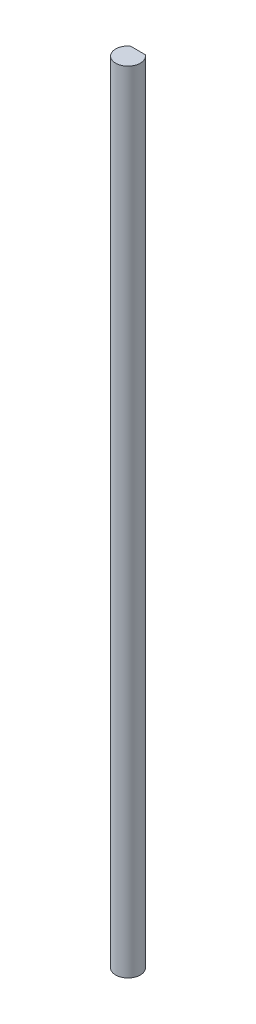
ISO-10303-21;
HEADER;
FILE_DESCRIPTION(('STEP AP214'),'2;1');
FILE_NAME('part.step','',(''),(''),'','','');
FILE_SCHEMA(('AUTOMOTIVE_DESIGN { 1 0 10303 214 1 1 1 1 }'));
ENDSEC;
DATA;
#1=APPLICATION_CONTEXT('core data for automotive mechanical design processes');
#2=APPLICATION_PROTOCOL_DEFINITION('international standard','automotive_design',2000,#1);
#3=PRODUCT_CONTEXT('',#1,'mechanical');
#4=PRODUCT('Part','Part','',(#3));
#5=PRODUCT_RELATED_PRODUCT_CATEGORY('part','',(#4));
#6=PRODUCT_DEFINITION_FORMATION('','',#4);
#7=PRODUCT_DEFINITION_CONTEXT('part definition',#1,'design');
#8=PRODUCT_DEFINITION('design','',#6,#7);
#9=PRODUCT_DEFINITION_SHAPE('','',#8);
#10=(LENGTH_UNIT() NAMED_UNIT(*) SI_UNIT(.MILLI.,.METRE.));
#11=(NAMED_UNIT(*) PLANE_ANGLE_UNIT() SI_UNIT($,.RADIAN.));
#12=(NAMED_UNIT(*) SI_UNIT($,.STERADIAN.) SOLID_ANGLE_UNIT());
#13=UNCERTAINTY_MEASURE_WITH_UNIT(LENGTH_MEASURE(1.E-05),#10,'distance_accuracy_value','');
#14=(GEOMETRIC_REPRESENTATION_CONTEXT(3) GLOBAL_UNCERTAINTY_ASSIGNED_CONTEXT((#13)) GLOBAL_UNIT_ASSIGNED_CONTEXT((#10,
#11,#12)) REPRESENTATION_CONTEXT('',''));
#15=CARTESIAN_POINT('',(0.,0.,0.));
#16=DIRECTION('',(0.,0.,1.));
#17=DIRECTION('',(1.,0.,0.));
#18=AXIS2_PLACEMENT_3D('',#15,#16,#17);
#19=CARTESIAN_POINT('',(0.,203.2,0.));
#20=DIRECTION('',(0.,-1.,0.));
#21=DIRECTION('',(0.,0.,-1.));
#22=AXIS2_PLACEMENT_3D('',#19,#20,#21);
#23=CYLINDRICAL_SURFACE('',#22,3.175);
#24=CARTESIAN_POINT('',(0.,0.,0.));
#25=DIRECTION('',(0.,1.,0.));
#26=DIRECTION('',(0.,0.,1.));
#27=AXIS2_PLACEMENT_3D('',#24,#25,#26);
#28=CIRCLE('',#27,3.175);
#29=CARTESIAN_POINT('',(-1.905,0.,-2.54));
#30=VERTEX_POINT('',#29);
#31=CARTESIAN_POINT('',(1.905,0.,-2.54));
#32=VERTEX_POINT('',#31);
#33=EDGE_CURVE('E64',#30,#32,#28,.T.);
#34=ORIENTED_EDGE('',*,*,#33,.T.);
#35=DIRECTION('',(0.,-1.,0.));
#36=VECTOR('',#35,1.);
#37=CARTESIAN_POINT('',(1.905,203.2,-2.54));
#38=LINE('',#37,#36);
#39=CARTESIAN_POINT('',(1.905,203.2,-2.54));
#40=VERTEX_POINT('',#39);
#41=EDGE_CURVE('E11',#40,#32,#38,.T.);
#42=ORIENTED_EDGE('',*,*,#41,.F.);
#43=CARTESIAN_POINT('',(0.,203.2,0.));
#44=DIRECTION('',(0.,1.,0.));
#45=DIRECTION('',(0.,0.,1.));
#46=AXIS2_PLACEMENT_3D('',#43,#44,#45);
#47=CIRCLE('',#46,3.175);
#48=CARTESIAN_POINT('',(-1.905,203.2,-2.54));
#49=VERTEX_POINT('',#48);
#50=EDGE_CURVE('E63',#49,#40,#47,.T.);
#51=ORIENTED_EDGE('',*,*,#50,.F.);
#52=DIRECTION('',(0.,-1.,0.));
#53=VECTOR('',#52,1.);
#54=CARTESIAN_POINT('',(-1.905,203.2,-2.54));
#55=LINE('',#54,#53);
#56=EDGE_CURVE('E41',#49,#30,#55,.T.);
#57=ORIENTED_EDGE('',*,*,#56,.T.);
#58=EDGE_LOOP('',(#34,#42,#51,#57));
#59=FACE_BOUND('',#58,.T.);
#60=ADVANCED_FACE('F33',(#59),#23,.T.);
#61=CARTESIAN_POINT('',(-1.905,203.2,-2.54));
#62=DIRECTION('',(0.,0.,1.));
#63=DIRECTION('',(1.,0.,0.));
#64=AXIS2_PLACEMENT_3D('',#61,#62,#63);
#65=PLANE('',#64);
#66=DIRECTION('',(-1.,0.,0.));
#67=VECTOR('',#66,1.);
#68=CARTESIAN_POINT('',(-1.905,0.,-2.54));
#69=LINE('',#68,#67);
#70=EDGE_CURVE('E56',#32,#30,#69,.T.);
#71=ORIENTED_EDGE('',*,*,#70,.T.);
#72=ORIENTED_EDGE('',*,*,#56,.F.);
#73=DIRECTION('',(-1.,0.,0.));
#74=VECTOR('',#73,1.);
#75=CARTESIAN_POINT('',(-1.905,203.2,-2.54));
#76=LINE('',#75,#74);
#77=EDGE_CURVE('E48',#40,#49,#76,.T.);
#78=ORIENTED_EDGE('',*,*,#77,.F.);
#79=ORIENTED_EDGE('',*,*,#41,.T.);
#80=EDGE_LOOP('',(#71,#72,#78,#79));
#81=FACE_BOUND('',#80,.T.);
#82=ADVANCED_FACE('F59',(#81),#65,.F.);
#83=CARTESIAN_POINT('',(0.,203.2,0.));
#84=DIRECTION('',(0.,1.,0.));
#85=DIRECTION('',(0.,0.,1.));
#86=AXIS2_PLACEMENT_3D('',#83,#84,#85);
#87=PLANE('',#86);
#88=ORIENTED_EDGE('',*,*,#50,.T.);
#89=ORIENTED_EDGE('',*,*,#77,.T.);
#90=EDGE_LOOP('',(#88,#89));
#91=FACE_BOUND('',#90,.T.);
#92=ADVANCED_FACE('F71',(#91),#87,.T.);
#93=CARTESIAN_POINT('',(0.,0.,0.));
#94=DIRECTION('',(0.,1.,0.));
#95=DIRECTION('',(0.,0.,1.));
#96=AXIS2_PLACEMENT_3D('',#93,#94,#95);
#97=PLANE('',#96);
#98=ORIENTED_EDGE('',*,*,#33,.F.);
#99=ORIENTED_EDGE('',*,*,#70,.F.);
#100=EDGE_LOOP('',(#98,#99));
#101=FACE_BOUND('',#100,.T.);
#102=ADVANCED_FACE('F67',(#101),#97,.F.);
#103=CLOSED_SHELL('',(#60,#82,#92,#102));
#104=MANIFOLD_SOLID_BREP('B2',#103);
#105=ADVANCED_BREP_SHAPE_REPRESENTATION('',(#18,#104),#14);
#106=SHAPE_DEFINITION_REPRESENTATION(#9,#105);
ENDSEC;
END-ISO-10303-21;
